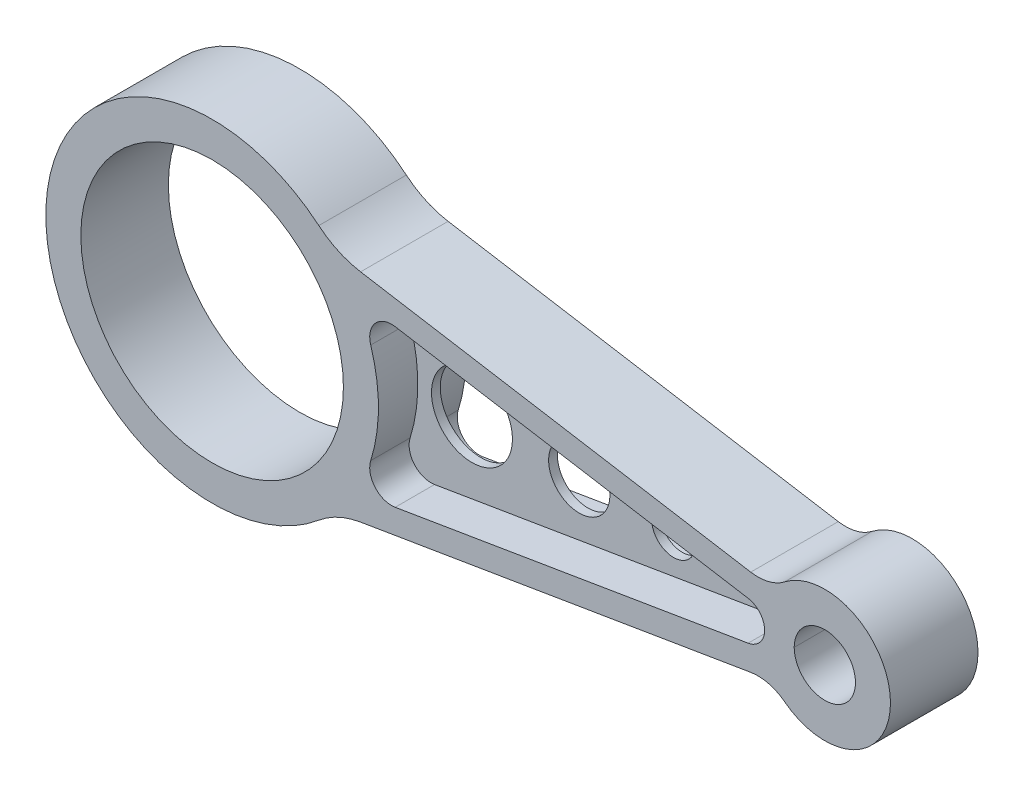
ISO-10303-21;
HEADER;
FILE_DESCRIPTION(('STEP AP214'),'2;1');
FILE_NAME('part.step','',(''),(''),'','','');
FILE_SCHEMA(('AUTOMOTIVE_DESIGN { 1 0 10303 214 1 1 1 1 }'));
ENDSEC;
DATA;
#1=APPLICATION_CONTEXT('core data for automotive mechanical design processes');
#2=APPLICATION_PROTOCOL_DEFINITION('international standard','automotive_design',2000,#1);
#3=PRODUCT_CONTEXT('',#1,'mechanical');
#4=PRODUCT('Part','Part','',(#3));
#5=PRODUCT_RELATED_PRODUCT_CATEGORY('part','',(#4));
#6=PRODUCT_DEFINITION_FORMATION('','',#4);
#7=PRODUCT_DEFINITION_CONTEXT('part definition',#1,'design');
#8=PRODUCT_DEFINITION('design','',#6,#7);
#9=PRODUCT_DEFINITION_SHAPE('','',#8);
#10=(LENGTH_UNIT() NAMED_UNIT(*) SI_UNIT(.MILLI.,.METRE.));
#11=(NAMED_UNIT(*) PLANE_ANGLE_UNIT() SI_UNIT($,.RADIAN.));
#12=(NAMED_UNIT(*) SI_UNIT($,.STERADIAN.) SOLID_ANGLE_UNIT());
#13=UNCERTAINTY_MEASURE_WITH_UNIT(LENGTH_MEASURE(1.E-05),#10,'distance_accuracy_value','');
#14=(GEOMETRIC_REPRESENTATION_CONTEXT(3) GLOBAL_UNCERTAINTY_ASSIGNED_CONTEXT((#13)) GLOBAL_UNIT_ASSIGNED_CONTEXT((#10,
#11,#12)) REPRESENTATION_CONTEXT('',''));
#15=CARTESIAN_POINT('',(0.,0.,0.));
#16=DIRECTION('',(0.,0.,1.));
#17=DIRECTION('',(1.,0.,0.));
#18=AXIS2_PLACEMENT_3D('',#15,#16,#17);
#19=CARTESIAN_POINT('',(140.,0.,10.));
#20=DIRECTION('',(0.,0.,-1.));
#21=DIRECTION('',(-1.,0.,0.));
#22=AXIS2_PLACEMENT_3D('',#19,#20,#21);
#23=CYLINDRICAL_SURFACE('',#22,7.00000000000001);
#24=CARTESIAN_POINT('',(140.,0.,10.));
#25=DIRECTION('',(0.,0.,1.));
#26=DIRECTION('',(1.,0.,0.));
#27=AXIS2_PLACEMENT_3D('',#24,#25,#26);
#28=CIRCLE('',#27,7.00000000000001);
#29=CARTESIAN_POINT('',(133.,0.,10.));
#30=VERTEX_POINT('',#29);
#31=CARTESIAN_POINT('',(147.,0.,10.));
#32=VERTEX_POINT('',#31);
#33=EDGE_CURVE('E337',#30,#32,#28,.T.);
#34=ORIENTED_EDGE('',*,*,#33,.T.);
#35=DIRECTION('',(0.,0.,-1.));
#36=VECTOR('',#35,1.);
#37=CARTESIAN_POINT('',(147.,0.,10.));
#38=LINE('',#37,#36);
#39=CARTESIAN_POINT('',(147.,0.,-10.));
#40=VERTEX_POINT('',#39);
#41=EDGE_CURVE('E11',#32,#40,#38,.T.);
#42=ORIENTED_EDGE('',*,*,#41,.T.);
#43=CARTESIAN_POINT('',(140.,0.,-10.));
#44=DIRECTION('',(0.,0.,1.));
#45=DIRECTION('',(1.,0.,0.));
#46=AXIS2_PLACEMENT_3D('',#43,#44,#45);
#47=CIRCLE('',#46,7.00000000000001);
#48=CARTESIAN_POINT('',(133.,0.,-10.));
#49=VERTEX_POINT('',#48);
#50=EDGE_CURVE('E342',#49,#40,#47,.T.);
#51=ORIENTED_EDGE('',*,*,#50,.F.);
#52=DIRECTION('',(0.,0.,1.));
#53=VECTOR('',#52,1.);
#54=CARTESIAN_POINT('',(133.,0.,10.));
#55=LINE('',#54,#53);
#56=EDGE_CURVE('E53',#49,#30,#55,.T.);
#57=ORIENTED_EDGE('',*,*,#56,.T.);
#58=EDGE_LOOP('',(#34,#42,#51,#57));
#59=FACE_BOUND('',#58,.T.);
#60=ADVANCED_FACE('F43',(#59),#23,.F.);
#61=CARTESIAN_POINT('',(0.,0.,10.));
#62=DIRECTION('',(0.,0.,-1.));
#63=DIRECTION('',(-1.,0.,0.));
#64=AXIS2_PLACEMENT_3D('',#61,#62,#63);
#65=PLANE('',#64);
#66=CARTESIAN_POINT('',(41.007125986905,-12.9389187451698,10.));
#67=DIRECTION('',(0.,0.,1.));
#68=DIRECTION('',(-1.,0.,0.));
#69=AXIS2_PLACEMENT_3D('',#66,#67,#68);
#70=CIRCLE('',#69,5.00000000000004);
#71=CARTESIAN_POINT('',(36.2388555233114,-11.4343933096849,10.));
#72=VERTEX_POINT('',#71);
#73=CARTESIAN_POINT('',(41.8285545583336,-17.8709827250914,10.));
#74=VERTEX_POINT('',#73);
#75=EDGE_CURVE('E299',#72,#74,#70,.T.);
#76=ORIENTED_EDGE('',*,*,#75,.F.);
#77=CARTESIAN_POINT('',(0.,0.,10.));
#78=DIRECTION('',(0.,0.,-1.));
#79=DIRECTION('',(-1.,0.,0.));
#80=AXIS2_PLACEMENT_3D('',#77,#78,#79);
#81=CIRCLE('',#80,38.);
#82=CARTESIAN_POINT('',(36.2388555233113,11.4343933096849,10.));
#83=VERTEX_POINT('',#82);
#84=EDGE_CURVE('E259',#83,#72,#81,.T.);
#85=ORIENTED_EDGE('',*,*,#84,.F.);
#86=CARTESIAN_POINT('',(41.0071259869049,12.9389187451698,10.));
#87=DIRECTION('',(0.,0.,1.));
#88=DIRECTION('',(-1.,0.,0.));
#89=AXIS2_PLACEMENT_3D('',#86,#87,#88);
#90=CIRCLE('',#89,5.);
#91=CARTESIAN_POINT('',(41.8285545583335,17.8709827250914,10.));
#92=VERTEX_POINT('',#91);
#93=EDGE_CURVE('E276',#92,#83,#90,.T.);
#94=ORIENTED_EDGE('',*,*,#93,.F.);
#95=DIRECTION('',(-0.986412795984335,0.164285714285714,0.));
#96=VECTOR('',#95,1.);
#97=CARTESIAN_POINT('',(41.8285545583335,17.8709827250914,10.));
#98=LINE('',#97,#96);
#99=CARTESIAN_POINT('',(122.478416149068,4.43885758192951,10.));
#100=VERTEX_POINT('',#99);
#101=EDGE_CURVE('E311',#100,#92,#98,.T.);
#102=ORIENTED_EDGE('',*,*,#101,.F.);
#103=CARTESIAN_POINT('',(121.739130434783,0.,10.));
#104=DIRECTION('',(0.,0.,1.));
#105=DIRECTION('',(-1.,0.,0.));
#106=AXIS2_PLACEMENT_3D('',#103,#104,#105);
#107=CIRCLE('',#106,4.5);
#108=CARTESIAN_POINT('',(122.478416149068,-4.43885758192951,10.));
#109=VERTEX_POINT('',#108);
#110=EDGE_CURVE('E307',#109,#100,#107,.T.);
#111=ORIENTED_EDGE('',*,*,#110,.F.);
#112=DIRECTION('',(0.986412795984335,0.164285714285714,0.));
#113=VECTOR('',#112,1.);
#114=CARTESIAN_POINT('',(41.8285545583336,-17.8709827250914,10.));
#115=LINE('',#114,#113);
#116=EDGE_CURVE('E303',#74,#109,#115,.T.);
#117=ORIENTED_EDGE('',*,*,#116,.F.);
#118=EDGE_LOOP('',(#76,#85,#94,#102,#111,#117));
#119=FACE_BOUND('',#118,.T.);
#120=DIRECTION('',(-0.986412795984335,0.164285714285714,0.));
#121=VECTOR('',#120,1.);
#122=CARTESIAN_POINT('',(27.9354736759495,25.7606154914888,10.));
#123=LINE('',#122,#121);
#124=CARTESIAN_POINT('',(123.068754783715,9.91629645714703,10.));
#125=VERTEX_POINT('',#124);
#126=CARTESIAN_POINT('',(33.9230677395359,24.763389815186,10.));
#127=VERTEX_POINT('',#126);
#128=EDGE_CURVE('E366',#125,#127,#123,.T.);
#129=ORIENTED_EDGE('',*,*,#128,.T.);
#130=CARTESIAN_POINT('',(37.2087820252502,44.4916457348727,10.));
#131=DIRECTION('',(0.,0.,-1.));
#132=DIRECTION('',(-1.,0.,0.));
#133=AXIS2_PLACEMENT_3D('',#130,#131,#132);
#134=CIRCLE('',#133,20.);
#135=CARTESIAN_POINT('',(24.3781675337846,29.1496989297442,10.));
#136=VERTEX_POINT('',#135);
#137=EDGE_CURVE('E434',#127,#136,#134,.T.);
#138=ORIENTED_EDGE('',*,*,#137,.T.);
#139=CARTESIAN_POINT('',(0.,0.,10.));
#140=DIRECTION('',(0.,0.,1.));
#141=DIRECTION('',(-1.,0.,0.));
#142=AXIS2_PLACEMENT_3D('',#139,#140,#141);
#143=CIRCLE('',#142,38.);
#144=CARTESIAN_POINT('',(24.3781675337846,-29.1496989297442,10.));
#145=VERTEX_POINT('',#144);
#146=EDGE_CURVE('E354',#136,#145,#143,.T.);
#147=ORIENTED_EDGE('',*,*,#146,.T.);
#148=CARTESIAN_POINT('',(37.2087820252501,-44.4916457348728,10.));
#149=DIRECTION('',(0.,0.,-1.));
#150=DIRECTION('',(-1.,0.,0.));
#151=AXIS2_PLACEMENT_3D('',#148,#149,#150);
#152=CIRCLE('',#151,20.);
#153=CARTESIAN_POINT('',(33.9230677395358,-24.7633898151861,10.));
#154=VERTEX_POINT('',#153);
#155=EDGE_CURVE('E428',#145,#154,#152,.T.);
#156=ORIENTED_EDGE('',*,*,#155,.T.);
#157=DIRECTION('',(0.986412795984335,0.164285714285714,0.));
#158=VECTOR('',#157,1.);
#159=CARTESIAN_POINT('',(27.9354736759495,-25.7606154914888,10.));
#160=LINE('',#159,#158);
#161=CARTESIAN_POINT('',(123.068754783715,-9.91629645714704,10.));
#162=VERTEX_POINT('',#161);
#163=EDGE_CURVE('E358',#154,#162,#160,.T.);
#164=ORIENTED_EDGE('',*,*,#163,.T.);
#165=CARTESIAN_POINT('',(124.711611926572,-19.7804244169904,10.));
#166=DIRECTION('',(0.,0.,-1.));
#167=DIRECTION('',(-1.,0.,0.));
#168=AXIS2_PLACEMENT_3D('',#165,#166,#167);
#169=CIRCLE('',#168,10.);
#170=CARTESIAN_POINT('',(130.826967155943,-11.8682546501942,10.));
#171=VERTEX_POINT('',#170);
#172=EDGE_CURVE('E408',#162,#171,#169,.T.);
#173=ORIENTED_EDGE('',*,*,#172,.T.);
#174=CARTESIAN_POINT('',(140.,0.,10.));
#175=DIRECTION('',(0.,0.,1.));
#176=DIRECTION('',(-1.,0.,0.));
#177=AXIS2_PLACEMENT_3D('',#174,#175,#176);
#178=CIRCLE('',#177,15.);
#179=CARTESIAN_POINT('',(130.826967155943,11.8682546501942,10.));
#180=VERTEX_POINT('',#179);
#181=EDGE_CURVE('E362',#171,#180,#178,.T.);
#182=ORIENTED_EDGE('',*,*,#181,.T.);
#183=CARTESIAN_POINT('',(124.711611926572,19.7804244169904,10.));
#184=DIRECTION('',(0.,0.,-1.));
#185=DIRECTION('',(-1.,0.,0.));
#186=AXIS2_PLACEMENT_3D('',#183,#184,#185);
#187=CIRCLE('',#186,10.);
#188=EDGE_CURVE('E401',#180,#125,#187,.T.);
#189=ORIENTED_EDGE('',*,*,#188,.T.);
#190=EDGE_LOOP('',(#129,#138,#147,#156,#164,#173,#182,#189));
#191=FACE_BOUND('',#190,.T.);
#192=CARTESIAN_POINT('',(0.,0.,10.));
#193=DIRECTION('',(0.,0.,1.));
#194=DIRECTION('',(1.,0.,0.));
#195=AXIS2_PLACEMENT_3D('',#192,#193,#194);
#196=CIRCLE('',#195,30.);
#197=CARTESIAN_POINT('',(30.,0.,10.));
#198=VERTEX_POINT('',#197);
#199=EDGE_CURVE('E346',#198,#198,#196,.T.);
#200=ORIENTED_EDGE('',*,*,#199,.F.);
#201=EDGE_LOOP('',(#200));
#202=FACE_BOUND('',#201,.T.);
#203=ORIENTED_EDGE('',*,*,#33,.F.);
#204=EDGE_CURVE('E341',#32,#30,#28,.T.);
#205=ORIENTED_EDGE('',*,*,#204,.F.);
#206=EDGE_LOOP('',(#203,#205));
#207=FACE_BOUND('',#206,.T.);
#208=ADVANCED_FACE('F471',(#119,#191,#202,#207),#65,.F.);
#209=CARTESIAN_POINT('',(0.,0.,-10.));
#210=DIRECTION('',(0.,0.,-1.));
#211=DIRECTION('',(-1.,0.,0.));
#212=AXIS2_PLACEMENT_3D('',#209,#210,#211);
#213=PLANE('',#212);
#214=CARTESIAN_POINT('',(41.0071259869049,12.9389187451698,-10.));
#215=DIRECTION('',(0.,0.,1.));
#216=DIRECTION('',(-1.,0.,0.));
#217=AXIS2_PLACEMENT_3D('',#214,#215,#216);
#218=CIRCLE('',#217,5.);
#219=CARTESIAN_POINT('',(41.8285545583335,17.8709827250914,-10.));
#220=VERTEX_POINT('',#219);
#221=CARTESIAN_POINT('',(36.2388555233113,11.4343933096849,-10.));
#222=VERTEX_POINT('',#221);
#223=EDGE_CURVE('E242',#220,#222,#218,.T.);
#224=ORIENTED_EDGE('',*,*,#223,.T.);
#225=CARTESIAN_POINT('',(0.,0.,-10.));
#226=DIRECTION('',(0.,0.,-1.));
#227=DIRECTION('',(-1.,0.,0.));
#228=AXIS2_PLACEMENT_3D('',#225,#226,#227);
#229=CIRCLE('',#228,38.);
#230=CARTESIAN_POINT('',(36.2388555233114,-11.4343933096849,-10.));
#231=VERTEX_POINT('',#230);
#232=EDGE_CURVE('E213',#222,#231,#229,.T.);
#233=ORIENTED_EDGE('',*,*,#232,.T.);
#234=CARTESIAN_POINT('',(41.007125986905,-12.9389187451698,-10.));
#235=DIRECTION('',(0.,0.,1.));
#236=DIRECTION('',(-1.,0.,0.));
#237=AXIS2_PLACEMENT_3D('',#234,#235,#236);
#238=CIRCLE('',#237,5.00000000000004);
#239=CARTESIAN_POINT('',(41.8285545583336,-17.8709827250914,-10.));
#240=VERTEX_POINT('',#239);
#241=EDGE_CURVE('E220',#231,#240,#238,.T.);
#242=ORIENTED_EDGE('',*,*,#241,.T.);
#243=DIRECTION('',(0.986412795984335,0.164285714285714,0.));
#244=VECTOR('',#243,1.);
#245=CARTESIAN_POINT('',(41.8285545583336,-17.8709827250914,-10.));
#246=LINE('',#245,#244);
#247=CARTESIAN_POINT('',(122.478416149068,-4.43885758192951,-10.));
#248=VERTEX_POINT('',#247);
#249=EDGE_CURVE('E224',#240,#248,#246,.T.);
#250=ORIENTED_EDGE('',*,*,#249,.T.);
#251=CARTESIAN_POINT('',(121.739130434783,0.,-10.));
#252=DIRECTION('',(0.,0.,1.));
#253=DIRECTION('',(-1.,0.,0.));
#254=AXIS2_PLACEMENT_3D('',#251,#252,#253);
#255=CIRCLE('',#254,4.5);
#256=CARTESIAN_POINT('',(122.478416149068,4.43885758192951,-10.));
#257=VERTEX_POINT('',#256);
#258=EDGE_CURVE('E249',#248,#257,#255,.T.);
#259=ORIENTED_EDGE('',*,*,#258,.T.);
#260=DIRECTION('',(-0.986412795984335,0.164285714285714,0.));
#261=VECTOR('',#260,1.);
#262=CARTESIAN_POINT('',(41.8285545583335,17.8709827250914,-10.));
#263=LINE('',#262,#261);
#264=EDGE_CURVE('E245',#257,#220,#263,.T.);
#265=ORIENTED_EDGE('',*,*,#264,.T.);
#266=EDGE_LOOP('',(#224,#233,#242,#250,#259,#265));
#267=FACE_BOUND('',#266,.T.);
#268=CARTESIAN_POINT('',(0.,0.,-10.));
#269=DIRECTION('',(0.,0.,1.));
#270=DIRECTION('',(1.,0.,0.));
#271=AXIS2_PLACEMENT_3D('',#268,#269,#270);
#272=CIRCLE('',#271,30.);
#273=CARTESIAN_POINT('',(30.,0.,-10.));
#274=VERTEX_POINT('',#273);
#275=EDGE_CURVE('E340',#274,#274,#272,.T.);
#276=ORIENTED_EDGE('',*,*,#275,.T.);
#277=EDGE_LOOP('',(#276));
#278=FACE_BOUND('',#277,.T.);
#279=CARTESIAN_POINT('',(0.,0.,-10.));
#280=DIRECTION('',(0.,0.,1.));
#281=DIRECTION('',(-1.,0.,0.));
#282=AXIS2_PLACEMENT_3D('',#279,#280,#281);
#283=CIRCLE('',#282,38.);
#284=CARTESIAN_POINT('',(24.3781675337846,29.1496989297442,-10.));
#285=VERTEX_POINT('',#284);
#286=CARTESIAN_POINT('',(24.3781675337846,-29.1496989297442,-10.));
#287=VERTEX_POINT('',#286);
#288=EDGE_CURVE('E350',#285,#287,#283,.T.);
#289=ORIENTED_EDGE('',*,*,#288,.F.);
#290=CARTESIAN_POINT('',(37.2087820252502,44.4916457348727,-10.));
#291=DIRECTION('',(0.,0.,-1.));
#292=DIRECTION('',(-1.,0.,0.));
#293=AXIS2_PLACEMENT_3D('',#290,#291,#292);
#294=CIRCLE('',#293,20.);
#295=CARTESIAN_POINT('',(33.9230677395359,24.763389815186,-10.));
#296=VERTEX_POINT('',#295);
#297=EDGE_CURVE('E431',#285,#296,#294,.F.);
#298=ORIENTED_EDGE('',*,*,#297,.T.);
#299=DIRECTION('',(-0.986412795984335,0.164285714285714,0.));
#300=VECTOR('',#299,1.);
#301=CARTESIAN_POINT('',(27.9354736759495,25.7606154914888,-10.));
#302=LINE('',#301,#300);
#303=CARTESIAN_POINT('',(123.068754783715,9.91629645714703,-10.));
#304=VERTEX_POINT('',#303);
#305=EDGE_CURVE('E359',#304,#296,#302,.T.);
#306=ORIENTED_EDGE('',*,*,#305,.F.);
#307=CARTESIAN_POINT('',(124.711611926572,19.7804244169904,-10.));
#308=DIRECTION('',(0.,0.,-1.));
#309=DIRECTION('',(-1.,0.,0.));
#310=AXIS2_PLACEMENT_3D('',#307,#308,#309);
#311=CIRCLE('',#310,10.);
#312=CARTESIAN_POINT('',(130.826967155943,11.8682546501942,-10.));
#313=VERTEX_POINT('',#312);
#314=EDGE_CURVE('E398',#304,#313,#311,.F.);
#315=ORIENTED_EDGE('',*,*,#314,.T.);
#316=CARTESIAN_POINT('',(140.,0.,-10.));
#317=DIRECTION('',(0.,0.,1.));
#318=DIRECTION('',(-1.,0.,0.));
#319=AXIS2_PLACEMENT_3D('',#316,#317,#318);
#320=CIRCLE('',#319,15.);
#321=CARTESIAN_POINT('',(130.826967155943,-11.8682546501942,-10.));
#322=VERTEX_POINT('',#321);
#323=EDGE_CURVE('E377',#322,#313,#320,.T.);
#324=ORIENTED_EDGE('',*,*,#323,.F.);
#325=CARTESIAN_POINT('',(124.711611926572,-19.7804244169904,-10.));
#326=DIRECTION('',(0.,0.,-1.));
#327=DIRECTION('',(-1.,0.,0.));
#328=AXIS2_PLACEMENT_3D('',#325,#326,#327);
#329=CIRCLE('',#328,10.);
#330=CARTESIAN_POINT('',(123.068754783715,-9.91629645714704,-10.));
#331=VERTEX_POINT('',#330);
#332=EDGE_CURVE('E404',#322,#331,#329,.F.);
#333=ORIENTED_EDGE('',*,*,#332,.T.);
#334=DIRECTION('',(0.986412795984335,0.164285714285714,0.));
#335=VECTOR('',#334,1.);
#336=CARTESIAN_POINT('',(27.9354736759495,-25.7606154914888,-10.));
#337=LINE('',#336,#335);
#338=CARTESIAN_POINT('',(33.9230677395358,-24.7633898151861,-10.));
#339=VERTEX_POINT('',#338);
#340=EDGE_CURVE('E374',#339,#331,#337,.T.);
#341=ORIENTED_EDGE('',*,*,#340,.F.);
#342=CARTESIAN_POINT('',(37.2087820252501,-44.4916457348728,-10.));
#343=DIRECTION('',(0.,0.,-1.));
#344=DIRECTION('',(-1.,0.,0.));
#345=AXIS2_PLACEMENT_3D('',#342,#343,#344);
#346=CIRCLE('',#345,20.);
#347=EDGE_CURVE('E425',#339,#287,#346,.F.);
#348=ORIENTED_EDGE('',*,*,#347,.T.);
#349=EDGE_LOOP('',(#289,#298,#306,#315,#324,#333,#341,#348));
#350=FACE_BOUND('',#349,.T.);
#351=ORIENTED_EDGE('',*,*,#50,.T.);
#352=EDGE_CURVE('E321',#40,#49,#47,.T.);
#353=ORIENTED_EDGE('',*,*,#352,.T.);
#354=EDGE_LOOP('',(#351,#353));
#355=FACE_BOUND('',#354,.T.);
#356=ADVANCED_FACE('F477',(#267,#278,#350,#355),#213,.T.);
#357=CARTESIAN_POINT('',(0.,0.,10.));
#358=DIRECTION('',(0.,0.,-1.));
#359=DIRECTION('',(-1.,0.,0.));
#360=AXIS2_PLACEMENT_3D('',#357,#358,#359);
#361=CYLINDRICAL_SURFACE('',#360,38.);
#362=ORIENTED_EDGE('',*,*,#288,.T.);
#363=DIRECTION('',(0.,0.,-1.));
#364=VECTOR('',#363,1.);
#365=CARTESIAN_POINT('',(24.3781675337846,-29.1496989297442,10.));
#366=LINE('',#365,#364);
#367=EDGE_CURVE('E419',#287,#145,#366,.F.);
#368=ORIENTED_EDGE('',*,*,#367,.T.);
#369=ORIENTED_EDGE('',*,*,#146,.F.);
#370=DIRECTION('',(0.,0.,-1.));
#371=VECTOR('',#370,1.);
#372=CARTESIAN_POINT('',(24.3781675337846,29.1496989297442,10.));
#373=LINE('',#372,#371);
#374=EDGE_CURVE('E415',#136,#285,#373,.T.);
#375=ORIENTED_EDGE('',*,*,#374,.T.);
#376=EDGE_LOOP('',(#362,#368,#369,#375));
#377=FACE_BOUND('',#376,.T.);
#378=ADVANCED_FACE('F503',(#377),#361,.T.);
#379=CARTESIAN_POINT('',(27.9354736759495,-25.7606154914888,10.));
#380=DIRECTION('',(-0.164285714285714,0.986412795984335,0.));
#381=DIRECTION('',(-0.986412795984335,-0.164285714285714,0.));
#382=AXIS2_PLACEMENT_3D('',#379,#380,#381);
#383=PLANE('',#382);
#384=ORIENTED_EDGE('',*,*,#163,.F.);
#385=DIRECTION('',(0.,0.,1.));
#386=VECTOR('',#385,1.);
#387=CARTESIAN_POINT('',(33.9230677395358,-24.7633898151861,-10.));
#388=LINE('',#387,#386);
#389=EDGE_CURVE('E411',#154,#339,#388,.F.);
#390=ORIENTED_EDGE('',*,*,#389,.T.);
#391=ORIENTED_EDGE('',*,*,#340,.T.);
#392=DIRECTION('',(0.,0.,1.));
#393=VECTOR('',#392,1.);
#394=CARTESIAN_POINT('',(123.068754783715,-9.91629645714704,10.));
#395=LINE('',#394,#393);
#396=EDGE_CURVE('E394',#331,#162,#395,.T.);
#397=ORIENTED_EDGE('',*,*,#396,.T.);
#398=EDGE_LOOP('',(#384,#390,#391,#397));
#399=FACE_BOUND('',#398,.T.);
#400=ADVANCED_FACE('F508',(#399),#383,.F.);
#401=CARTESIAN_POINT('',(140.,0.,10.));
#402=DIRECTION('',(0.,0.,-1.));
#403=DIRECTION('',(-1.,0.,0.));
#404=AXIS2_PLACEMENT_3D('',#401,#402,#403);
#405=CYLINDRICAL_SURFACE('',#404,15.);
#406=ORIENTED_EDGE('',*,*,#323,.T.);
#407=DIRECTION('',(0.,0.,-1.));
#408=VECTOR('',#407,1.);
#409=CARTESIAN_POINT('',(130.826967155943,11.8682546501942,10.));
#410=LINE('',#409,#408);
#411=EDGE_CURVE('E391',#313,#180,#410,.F.);
#412=ORIENTED_EDGE('',*,*,#411,.T.);
#413=ORIENTED_EDGE('',*,*,#181,.F.);
#414=DIRECTION('',(0.,0.,-1.));
#415=VECTOR('',#414,1.);
#416=CARTESIAN_POINT('',(130.826967155943,-11.8682546501942,10.));
#417=LINE('',#416,#415);
#418=EDGE_CURVE('E387',#171,#322,#417,.T.);
#419=ORIENTED_EDGE('',*,*,#418,.T.);
#420=EDGE_LOOP('',(#406,#412,#413,#419));
#421=FACE_BOUND('',#420,.T.);
#422=ADVANCED_FACE('F497',(#421),#405,.T.);
#423=CARTESIAN_POINT('',(27.9354736759495,25.7606154914888,10.));
#424=DIRECTION('',(-0.164285714285714,-0.986412795984335,0.));
#425=DIRECTION('',(0.986412795984335,-0.164285714285714,0.));
#426=AXIS2_PLACEMENT_3D('',#423,#424,#425);
#427=PLANE('',#426);
#428=ORIENTED_EDGE('',*,*,#305,.T.);
#429=DIRECTION('',(0.,0.,1.));
#430=VECTOR('',#429,1.);
#431=CARTESIAN_POINT('',(33.9230677395359,24.763389815186,10.));
#432=LINE('',#431,#430);
#433=EDGE_CURVE('E422',#296,#127,#432,.T.);
#434=ORIENTED_EDGE('',*,*,#433,.T.);
#435=ORIENTED_EDGE('',*,*,#128,.F.);
#436=DIRECTION('',(0.,0.,1.));
#437=VECTOR('',#436,1.);
#438=CARTESIAN_POINT('',(123.068754783715,9.91629645714703,-10.));
#439=LINE('',#438,#437);
#440=EDGE_CURVE('E370',#125,#304,#439,.F.);
#441=ORIENTED_EDGE('',*,*,#440,.T.);
#442=EDGE_LOOP('',(#428,#434,#435,#441));
#443=FACE_BOUND('',#442,.T.);
#444=ADVANCED_FACE('F492',(#443),#427,.F.);
#445=CARTESIAN_POINT('',(0.,0.,10.));
#446=DIRECTION('',(0.,0.,-1.));
#447=DIRECTION('',(-1.,0.,0.));
#448=AXIS2_PLACEMENT_3D('',#445,#446,#447);
#449=CYLINDRICAL_SURFACE('',#448,30.);
#450=ORIENTED_EDGE('',*,*,#199,.T.);
#451=EDGE_LOOP('',(#450));
#452=FACE_BOUND('',#451,.T.);
#453=ORIENTED_EDGE('',*,*,#275,.F.);
#454=EDGE_LOOP('',(#453));
#455=FACE_BOUND('',#454,.T.);
#456=ADVANCED_FACE('F484',(#452,#455),#449,.F.);
#457=ORIENTED_EDGE('',*,*,#41,.F.);
#458=ORIENTED_EDGE('',*,*,#204,.T.);
#459=ORIENTED_EDGE('',*,*,#56,.F.);
#460=ORIENTED_EDGE('',*,*,#352,.F.);
#461=EDGE_LOOP('',(#457,#458,#459,#460));
#462=FACE_BOUND('',#461,.T.);
#463=ADVANCED_FACE('F473',(#462),#23,.F.);
#464=CARTESIAN_POINT('',(124.711611926572,19.7804244169904,10.));
#465=DIRECTION('',(0.,0.,-1.));
#466=DIRECTION('',(-1.,0.,0.));
#467=AXIS2_PLACEMENT_3D('',#464,#465,#466);
#468=CYLINDRICAL_SURFACE('',#467,10.);
#469=ORIENTED_EDGE('',*,*,#188,.F.);
#470=ORIENTED_EDGE('',*,*,#411,.F.);
#471=ORIENTED_EDGE('',*,*,#314,.F.);
#472=ORIENTED_EDGE('',*,*,#440,.F.);
#473=EDGE_LOOP('',(#469,#470,#471,#472));
#474=FACE_BOUND('',#473,.T.);
#475=ADVANCED_FACE('F483',(#474),#468,.F.);
#476=CARTESIAN_POINT('',(124.711611926572,-19.7804244169904,10.));
#477=DIRECTION('',(0.,0.,-1.));
#478=DIRECTION('',(-1.,0.,0.));
#479=AXIS2_PLACEMENT_3D('',#476,#477,#478);
#480=CYLINDRICAL_SURFACE('',#479,10.);
#481=ORIENTED_EDGE('',*,*,#172,.F.);
#482=ORIENTED_EDGE('',*,*,#396,.F.);
#483=ORIENTED_EDGE('',*,*,#332,.F.);
#484=ORIENTED_EDGE('',*,*,#418,.F.);
#485=EDGE_LOOP('',(#481,#482,#483,#484));
#486=FACE_BOUND('',#485,.T.);
#487=ADVANCED_FACE('F489',(#486),#480,.F.);
#488=CARTESIAN_POINT('',(37.2087820252501,-44.4916457348728,10.));
#489=DIRECTION('',(0.,0.,-1.));
#490=DIRECTION('',(-1.,0.,0.));
#491=AXIS2_PLACEMENT_3D('',#488,#489,#490);
#492=CYLINDRICAL_SURFACE('',#491,20.);
#493=ORIENTED_EDGE('',*,*,#155,.F.);
#494=ORIENTED_EDGE('',*,*,#367,.F.);
#495=ORIENTED_EDGE('',*,*,#347,.F.);
#496=ORIENTED_EDGE('',*,*,#389,.F.);
#497=EDGE_LOOP('',(#493,#494,#495,#496));
#498=FACE_BOUND('',#497,.T.);
#499=ADVANCED_FACE('F517',(#498),#492,.F.);
#500=CARTESIAN_POINT('',(37.2087820252502,44.4916457348727,10.));
#501=DIRECTION('',(0.,0.,-1.));
#502=DIRECTION('',(-1.,0.,0.));
#503=AXIS2_PLACEMENT_3D('',#500,#501,#502);
#504=CYLINDRICAL_SURFACE('',#503,20.);
#505=ORIENTED_EDGE('',*,*,#137,.F.);
#506=ORIENTED_EDGE('',*,*,#433,.F.);
#507=ORIENTED_EDGE('',*,*,#297,.F.);
#508=ORIENTED_EDGE('',*,*,#374,.F.);
#509=EDGE_LOOP('',(#505,#506,#507,#508));
#510=FACE_BOUND('',#509,.T.);
#511=ADVANCED_FACE('F45',(#510),#504,.F.);
#512=CARTESIAN_POINT('',(0.,0.,1.));
#513=DIRECTION('',(0.,0.,1.));
#514=DIRECTION('',(1.,0.,0.));
#515=AXIS2_PLACEMENT_3D('',#512,#513,#514);
#516=CYLINDRICAL_SURFACE('',#515,38.);
#517=ORIENTED_EDGE('',*,*,#84,.T.);
#518=DIRECTION('',(0.,0.,1.));
#519=VECTOR('',#518,1.);
#520=CARTESIAN_POINT('',(36.2388555233114,-11.4343933096849,1.));
#521=LINE('',#520,#519);
#522=CARTESIAN_POINT('',(36.2388555233114,-11.4343933096849,1.));
#523=VERTEX_POINT('',#522);
#524=EDGE_CURVE('E296',#523,#72,#521,.T.);
#525=ORIENTED_EDGE('',*,*,#524,.F.);
#526=CARTESIAN_POINT('',(0.,0.,1.));
#527=DIRECTION('',(0.,0.,-1.));
#528=DIRECTION('',(-1.,0.,0.));
#529=AXIS2_PLACEMENT_3D('',#526,#527,#528);
#530=CIRCLE('',#529,38.);
#531=CARTESIAN_POINT('',(36.2388555233113,11.4343933096849,1.));
#532=VERTEX_POINT('',#531);
#533=EDGE_CURVE('E271',#532,#523,#530,.T.);
#534=ORIENTED_EDGE('',*,*,#533,.F.);
#535=DIRECTION('',(0.,0.,1.));
#536=VECTOR('',#535,1.);
#537=CARTESIAN_POINT('',(36.2388555233113,11.4343933096849,1.));
#538=LINE('',#537,#536);
#539=EDGE_CURVE('E318',#532,#83,#538,.T.);
#540=ORIENTED_EDGE('',*,*,#539,.T.);
#541=EDGE_LOOP('',(#517,#525,#534,#540));
#542=FACE_BOUND('',#541,.T.);
#543=ADVANCED_FACE('F524',(#542),#516,.T.);
#544=CARTESIAN_POINT('',(41.0071259869049,12.9389187451698,1.));
#545=DIRECTION('',(0.,0.,1.));
#546=DIRECTION('',(1.,0.,0.));
#547=AXIS2_PLACEMENT_3D('',#544,#545,#546);
#548=CYLINDRICAL_SURFACE('',#547,5.);
#549=ORIENTED_EDGE('',*,*,#93,.T.);
#550=ORIENTED_EDGE('',*,*,#539,.F.);
#551=CARTESIAN_POINT('',(41.0071259869049,12.9389187451698,1.));
#552=DIRECTION('',(0.,0.,1.));
#553=DIRECTION('',(-1.,0.,0.));
#554=AXIS2_PLACEMENT_3D('',#551,#552,#553);
#555=CIRCLE('',#554,5.);
#556=CARTESIAN_POINT('',(41.8285545583335,17.8709827250914,1.));
#557=VERTEX_POINT('',#556);
#558=EDGE_CURVE('E292',#557,#532,#555,.T.);
#559=ORIENTED_EDGE('',*,*,#558,.F.);
#560=DIRECTION('',(0.,0.,1.));
#561=VECTOR('',#560,1.);
#562=CARTESIAN_POINT('',(41.8285545583335,17.8709827250914,1.));
#563=LINE('',#562,#561);
#564=EDGE_CURVE('E322',#557,#92,#563,.T.);
#565=ORIENTED_EDGE('',*,*,#564,.T.);
#566=EDGE_LOOP('',(#549,#550,#559,#565));
#567=FACE_BOUND('',#566,.T.);
#568=ADVANCED_FACE('F565',(#567),#548,.F.);
#569=CARTESIAN_POINT('',(41.8285545583335,17.8709827250914,1.));
#570=DIRECTION('',(0.164285714285714,0.986412795984335,0.));
#571=DIRECTION('',(-0.986412795984335,0.164285714285714,0.));
#572=AXIS2_PLACEMENT_3D('',#569,#570,#571);
#573=PLANE('',#572);
#574=ORIENTED_EDGE('',*,*,#101,.T.);
#575=ORIENTED_EDGE('',*,*,#564,.F.);
#576=DIRECTION('',(-0.986412795984335,0.164285714285714,0.));
#577=VECTOR('',#576,1.);
#578=CARTESIAN_POINT('',(41.8285545583335,17.8709827250914,1.));
#579=LINE('',#578,#577);
#580=CARTESIAN_POINT('',(122.478416149068,4.43885758192951,1.));
#581=VERTEX_POINT('',#580);
#582=EDGE_CURVE('E288',#581,#557,#579,.T.);
#583=ORIENTED_EDGE('',*,*,#582,.F.);
#584=DIRECTION('',(0.,0.,1.));
#585=VECTOR('',#584,1.);
#586=CARTESIAN_POINT('',(122.478416149068,4.43885758192951,1.));
#587=LINE('',#586,#585);
#588=EDGE_CURVE('E325',#581,#100,#587,.T.);
#589=ORIENTED_EDGE('',*,*,#588,.T.);
#590=EDGE_LOOP('',(#574,#575,#583,#589));
#591=FACE_BOUND('',#590,.T.);
#592=ADVANCED_FACE('F570',(#591),#573,.F.);
#593=CARTESIAN_POINT('',(121.739130434783,0.,1.));
#594=DIRECTION('',(0.,0.,1.));
#595=DIRECTION('',(1.,0.,0.));
#596=AXIS2_PLACEMENT_3D('',#593,#594,#595);
#597=CYLINDRICAL_SURFACE('',#596,4.5);
#598=ORIENTED_EDGE('',*,*,#110,.T.);
#599=ORIENTED_EDGE('',*,*,#588,.F.);
#600=CARTESIAN_POINT('',(121.739130434783,0.,1.));
#601=DIRECTION('',(0.,0.,1.));
#602=DIRECTION('',(-1.,0.,0.));
#603=AXIS2_PLACEMENT_3D('',#600,#601,#602);
#604=CIRCLE('',#603,4.5);
#605=CARTESIAN_POINT('',(122.478416149068,-4.43885758192951,1.));
#606=VERTEX_POINT('',#605);
#607=EDGE_CURVE('E284',#606,#581,#604,.T.);
#608=ORIENTED_EDGE('',*,*,#607,.F.);
#609=DIRECTION('',(0.,0.,1.));
#610=VECTOR('',#609,1.);
#611=CARTESIAN_POINT('',(122.478416149068,-4.43885758192951,1.));
#612=LINE('',#611,#610);
#613=EDGE_CURVE('E328',#606,#109,#612,.T.);
#614=ORIENTED_EDGE('',*,*,#613,.T.);
#615=EDGE_LOOP('',(#598,#599,#608,#614));
#616=FACE_BOUND('',#615,.T.);
#617=ADVANCED_FACE('F582',(#616),#597,.F.);
#618=CARTESIAN_POINT('',(41.8285545583336,-17.8709827250914,1.));
#619=DIRECTION('',(0.164285714285714,-0.986412795984335,0.));
#620=DIRECTION('',(0.986412795984335,0.164285714285714,0.));
#621=AXIS2_PLACEMENT_3D('',#618,#619,#620);
#622=PLANE('',#621);
#623=ORIENTED_EDGE('',*,*,#116,.T.);
#624=ORIENTED_EDGE('',*,*,#613,.F.);
#625=DIRECTION('',(0.986412795984335,0.164285714285714,0.));
#626=VECTOR('',#625,1.);
#627=CARTESIAN_POINT('',(41.8285545583336,-17.8709827250914,1.));
#628=LINE('',#627,#626);
#629=CARTESIAN_POINT('',(41.8285545583336,-17.8709827250914,1.));
#630=VERTEX_POINT('',#629);
#631=EDGE_CURVE('E280',#630,#606,#628,.T.);
#632=ORIENTED_EDGE('',*,*,#631,.F.);
#633=DIRECTION('',(0.,0.,1.));
#634=VECTOR('',#633,1.);
#635=CARTESIAN_POINT('',(41.8285545583336,-17.8709827250914,1.));
#636=LINE('',#635,#634);
#637=EDGE_CURVE('E331',#630,#74,#636,.T.);
#638=ORIENTED_EDGE('',*,*,#637,.T.);
#639=EDGE_LOOP('',(#623,#624,#632,#638));
#640=FACE_BOUND('',#639,.T.);
#641=ADVANCED_FACE('F578',(#640),#622,.F.);
#642=CARTESIAN_POINT('',(41.007125986905,-12.9389187451698,1.));
#643=DIRECTION('',(0.,0.,1.));
#644=DIRECTION('',(1.,0.,0.));
#645=AXIS2_PLACEMENT_3D('',#642,#643,#644);
#646=CYLINDRICAL_SURFACE('',#645,5.00000000000004);
#647=ORIENTED_EDGE('',*,*,#75,.T.);
#648=ORIENTED_EDGE('',*,*,#637,.F.);
#649=CARTESIAN_POINT('',(41.007125986905,-12.9389187451698,1.));
#650=DIRECTION('',(0.,0.,1.));
#651=DIRECTION('',(-1.,0.,0.));
#652=AXIS2_PLACEMENT_3D('',#649,#650,#651);
#653=CIRCLE('',#652,5.00000000000004);
#654=EDGE_CURVE('E275',#523,#630,#653,.T.);
#655=ORIENTED_EDGE('',*,*,#654,.F.);
#656=ORIENTED_EDGE('',*,*,#524,.T.);
#657=EDGE_LOOP('',(#647,#648,#655,#656));
#658=FACE_BOUND('',#657,.T.);
#659=ADVANCED_FACE('F574',(#658),#646,.F.);
#660=CARTESIAN_POINT('',(0.,0.,1.));
#661=DIRECTION('',(0.,0.,-1.));
#662=DIRECTION('',(-1.,0.,0.));
#663=AXIS2_PLACEMENT_3D('',#660,#661,#662);
#664=PLANE('',#663);
#665=CARTESIAN_POINT('',(50.3713688216154,0.,1.));
#666=DIRECTION('',(0.,0.,1.));
#667=DIRECTION('',(1.,0.,0.));
#668=AXIS2_PLACEMENT_3D('',#665,#666,#667);
#669=CIRCLE('',#668,9.25);
#670=CARTESIAN_POINT('',(59.6213688216154,0.,1.));
#671=VERTEX_POINT('',#670);
#672=EDGE_CURVE('E445',#671,#671,#669,.T.);
#673=ORIENTED_EDGE('',*,*,#672,.F.);
#674=EDGE_LOOP('',(#673));
#675=FACE_BOUND('',#674,.T.);
#676=CARTESIAN_POINT('',(74.8899101595823,0.,1.));
#677=DIRECTION('',(0.,0.,1.));
#678=DIRECTION('',(1.,0.,0.));
#679=AXIS2_PLACEMENT_3D('',#676,#677,#678);
#680=CIRCLE('',#679,7.);
#681=CARTESIAN_POINT('',(81.8899101595823,0.,1.));
#682=VERTEX_POINT('',#681);
#683=EDGE_CURVE('E634',#682,#682,#680,.T.);
#684=ORIENTED_EDGE('',*,*,#683,.F.);
#685=EDGE_LOOP('',(#684));
#686=FACE_BOUND('',#685,.T.);
#687=CARTESIAN_POINT('',(96.4405081274505,0.,1.));
#688=DIRECTION('',(0.,0.,1.));
#689=DIRECTION('',(1.,0.,0.));
#690=AXIS2_PLACEMENT_3D('',#687,#688,#689);
#691=CIRCLE('',#690,5.);
#692=CARTESIAN_POINT('',(101.440508127451,0.,1.));
#693=VERTEX_POINT('',#692);
#694=EDGE_CURVE('E626',#693,#693,#691,.T.);
#695=ORIENTED_EDGE('',*,*,#694,.F.);
#696=EDGE_LOOP('',(#695));
#697=FACE_BOUND('',#696,.T.);
#698=CARTESIAN_POINT('',(112.976627130934,0.,1.));
#699=DIRECTION('',(0.,0.,1.));
#700=DIRECTION('',(1.,0.,0.));
#701=AXIS2_PLACEMENT_3D('',#698,#699,#700);
#702=CIRCLE('',#701,3.02375892794177);
#703=CARTESIAN_POINT('',(116.000386058876,0.,1.));
#704=VERTEX_POINT('',#703);
#705=EDGE_CURVE('E227',#704,#704,#702,.T.);
#706=ORIENTED_EDGE('',*,*,#705,.F.);
#707=EDGE_LOOP('',(#706));
#708=FACE_BOUND('',#707,.T.);
#709=ORIENTED_EDGE('',*,*,#533,.T.);
#710=ORIENTED_EDGE('',*,*,#654,.T.);
#711=ORIENTED_EDGE('',*,*,#631,.T.);
#712=ORIENTED_EDGE('',*,*,#607,.T.);
#713=ORIENTED_EDGE('',*,*,#582,.T.);
#714=ORIENTED_EDGE('',*,*,#558,.T.);
#715=EDGE_LOOP('',(#709,#710,#711,#712,#713,#714));
#716=FACE_BOUND('',#715,.T.);
#717=ADVANCED_FACE('F577',(#675,#686,#697,#708,#716),#664,.F.);
#718=CARTESIAN_POINT('',(0.,0.,-1.));
#719=DIRECTION('',(0.,0.,-1.));
#720=DIRECTION('',(-1.,0.,0.));
#721=AXIS2_PLACEMENT_3D('',#718,#719,#720);
#722=CYLINDRICAL_SURFACE('',#721,38.);
#723=ORIENTED_EDGE('',*,*,#232,.F.);
#724=DIRECTION('',(0.,0.,-1.));
#725=VECTOR('',#724,1.);
#726=CARTESIAN_POINT('',(36.2388555233113,11.4343933096849,-1.));
#727=LINE('',#726,#725);
#728=CARTESIAN_POINT('',(36.2388555233113,11.4343933096849,-1.));
#729=VERTEX_POINT('',#728);
#730=EDGE_CURVE('E197',#729,#222,#727,.T.);
#731=ORIENTED_EDGE('',*,*,#730,.F.);
#732=CARTESIAN_POINT('',(0.,0.,-1.));
#733=DIRECTION('',(0.,0.,-1.));
#734=DIRECTION('',(-1.,0.,0.));
#735=AXIS2_PLACEMENT_3D('',#732,#733,#734);
#736=CIRCLE('',#735,38.);
#737=CARTESIAN_POINT('',(36.2388555233114,-11.4343933096849,-1.));
#738=VERTEX_POINT('',#737);
#739=EDGE_CURVE('E205',#729,#738,#736,.T.);
#740=ORIENTED_EDGE('',*,*,#739,.T.);
#741=DIRECTION('',(0.,0.,-1.));
#742=VECTOR('',#741,1.);
#743=CARTESIAN_POINT('',(36.2388555233114,-11.4343933096849,-1.));
#744=LINE('',#743,#742);
#745=EDGE_CURVE('E256',#738,#231,#744,.T.);
#746=ORIENTED_EDGE('',*,*,#745,.T.);
#747=EDGE_LOOP('',(#723,#731,#740,#746));
#748=FACE_BOUND('',#747,.T.);
#749=ADVANCED_FACE('F209',(#748),#722,.T.);
#750=CARTESIAN_POINT('',(41.007125986905,-12.9389187451698,-1.));
#751=DIRECTION('',(0.,0.,-1.));
#752=DIRECTION('',(-1.,0.,0.));
#753=AXIS2_PLACEMENT_3D('',#750,#751,#752);
#754=CYLINDRICAL_SURFACE('',#753,5.00000000000004);
#755=ORIENTED_EDGE('',*,*,#241,.F.);
#756=ORIENTED_EDGE('',*,*,#745,.F.);
#757=CARTESIAN_POINT('',(41.007125986905,-12.9389187451698,-1.));
#758=DIRECTION('',(0.,0.,1.));
#759=DIRECTION('',(-1.,0.,0.));
#760=AXIS2_PLACEMENT_3D('',#757,#758,#759);
#761=CIRCLE('',#760,5.00000000000004);
#762=CARTESIAN_POINT('',(41.8285545583336,-17.8709827250914,-1.));
#763=VERTEX_POINT('',#762);
#764=EDGE_CURVE('E215',#738,#763,#761,.T.);
#765=ORIENTED_EDGE('',*,*,#764,.T.);
#766=DIRECTION('',(0.,0.,-1.));
#767=VECTOR('',#766,1.);
#768=CARTESIAN_POINT('',(41.8285545583336,-17.8709827250914,-1.));
#769=LINE('',#768,#767);
#770=EDGE_CURVE('E260',#763,#240,#769,.T.);
#771=ORIENTED_EDGE('',*,*,#770,.T.);
#772=EDGE_LOOP('',(#755,#756,#765,#771));
#773=FACE_BOUND('',#772,.T.);
#774=ADVANCED_FACE('F595',(#773),#754,.F.);
#775=CARTESIAN_POINT('',(41.8285545583336,-17.8709827250914,-1.));
#776=DIRECTION('',(-0.164285714285714,0.986412795984335,0.));
#777=DIRECTION('',(-0.986412795984335,-0.164285714285714,0.));
#778=AXIS2_PLACEMENT_3D('',#775,#776,#777);
#779=PLANE('',#778);
#780=ORIENTED_EDGE('',*,*,#249,.F.);
#781=ORIENTED_EDGE('',*,*,#770,.F.);
#782=DIRECTION('',(0.986412795984335,0.164285714285714,0.));
#783=VECTOR('',#782,1.);
#784=CARTESIAN_POINT('',(41.8285545583336,-17.8709827250914,-1.));
#785=LINE('',#784,#783);
#786=CARTESIAN_POINT('',(122.478416149068,-4.43885758192951,-1.));
#787=VERTEX_POINT('',#786);
#788=EDGE_CURVE('E235',#763,#787,#785,.T.);
#789=ORIENTED_EDGE('',*,*,#788,.T.);
#790=DIRECTION('',(0.,0.,-1.));
#791=VECTOR('',#790,1.);
#792=CARTESIAN_POINT('',(122.478416149068,-4.43885758192951,-1.));
#793=LINE('',#792,#791);
#794=EDGE_CURVE('E263',#787,#248,#793,.T.);
#795=ORIENTED_EDGE('',*,*,#794,.T.);
#796=EDGE_LOOP('',(#780,#781,#789,#795));
#797=FACE_BOUND('',#796,.T.);
#798=ADVANCED_FACE('F605',(#797),#779,.T.);
#799=CARTESIAN_POINT('',(121.739130434783,0.,-1.));
#800=DIRECTION('',(0.,0.,-1.));
#801=DIRECTION('',(-1.,0.,0.));
#802=AXIS2_PLACEMENT_3D('',#799,#800,#801);
#803=CYLINDRICAL_SURFACE('',#802,4.5);
#804=ORIENTED_EDGE('',*,*,#258,.F.);
#805=ORIENTED_EDGE('',*,*,#794,.F.);
#806=CARTESIAN_POINT('',(121.739130434783,0.,-1.));
#807=DIRECTION('',(0.,0.,1.));
#808=DIRECTION('',(-1.,0.,0.));
#809=AXIS2_PLACEMENT_3D('',#806,#807,#808);
#810=CIRCLE('',#809,4.5);
#811=CARTESIAN_POINT('',(122.478416149068,4.43885758192951,-1.));
#812=VERTEX_POINT('',#811);
#813=EDGE_CURVE('E232',#787,#812,#810,.T.);
#814=ORIENTED_EDGE('',*,*,#813,.T.);
#815=DIRECTION('',(0.,0.,-1.));
#816=VECTOR('',#815,1.);
#817=CARTESIAN_POINT('',(122.478416149068,4.43885758192951,-1.));
#818=LINE('',#817,#816);
#819=EDGE_CURVE('E266',#812,#257,#818,.T.);
#820=ORIENTED_EDGE('',*,*,#819,.T.);
#821=EDGE_LOOP('',(#804,#805,#814,#820));
#822=FACE_BOUND('',#821,.T.);
#823=ADVANCED_FACE('F601',(#822),#803,.F.);
#824=CARTESIAN_POINT('',(41.8285545583335,17.8709827250914,-1.));
#825=DIRECTION('',(-0.164285714285714,-0.986412795984335,0.));
#826=DIRECTION('',(0.986412795984335,-0.164285714285714,0.));
#827=AXIS2_PLACEMENT_3D('',#824,#825,#826);
#828=PLANE('',#827);
#829=ORIENTED_EDGE('',*,*,#264,.F.);
#830=ORIENTED_EDGE('',*,*,#819,.F.);
#831=DIRECTION('',(-0.986412795984335,0.164285714285714,0.));
#832=VECTOR('',#831,1.);
#833=CARTESIAN_POINT('',(41.8285545583335,17.8709827250914,-1.));
#834=LINE('',#833,#832);
#835=CARTESIAN_POINT('',(41.8285545583335,17.8709827250914,-1.));
#836=VERTEX_POINT('',#835);
#837=EDGE_CURVE('E204',#812,#836,#834,.T.);
#838=ORIENTED_EDGE('',*,*,#837,.T.);
#839=DIRECTION('',(0.,0.,-1.));
#840=VECTOR('',#839,1.);
#841=CARTESIAN_POINT('',(41.8285545583335,17.8709827250914,-1.));
#842=LINE('',#841,#840);
#843=EDGE_CURVE('E199',#836,#220,#842,.T.);
#844=ORIENTED_EDGE('',*,*,#843,.T.);
#845=EDGE_LOOP('',(#829,#830,#838,#844));
#846=FACE_BOUND('',#845,.T.);
#847=ADVANCED_FACE('F598',(#846),#828,.T.);
#848=CARTESIAN_POINT('',(41.0071259869049,12.9389187451698,-1.));
#849=DIRECTION('',(0.,0.,-1.));
#850=DIRECTION('',(-1.,0.,0.));
#851=AXIS2_PLACEMENT_3D('',#848,#849,#850);
#852=CYLINDRICAL_SURFACE('',#851,5.);
#853=ORIENTED_EDGE('',*,*,#223,.F.);
#854=ORIENTED_EDGE('',*,*,#843,.F.);
#855=CARTESIAN_POINT('',(41.0071259869049,12.9389187451698,-1.));
#856=DIRECTION('',(0.,0.,1.));
#857=DIRECTION('',(-1.,0.,0.));
#858=AXIS2_PLACEMENT_3D('',#855,#856,#857);
#859=CIRCLE('',#858,5.);
#860=EDGE_CURVE('E193',#836,#729,#859,.T.);
#861=ORIENTED_EDGE('',*,*,#860,.T.);
#862=ORIENTED_EDGE('',*,*,#730,.T.);
#863=EDGE_LOOP('',(#853,#854,#861,#862));
#864=FACE_BOUND('',#863,.T.);
#865=ADVANCED_FACE('F196',(#864),#852,.F.);
#866=CARTESIAN_POINT('',(0.,0.,-1.));
#867=DIRECTION('',(0.,0.,1.));
#868=DIRECTION('',(-1.,0.,0.));
#869=AXIS2_PLACEMENT_3D('',#866,#867,#868);
#870=PLANE('',#869);
#871=CARTESIAN_POINT('',(50.3713688216154,0.,-1.));
#872=DIRECTION('',(0.,0.,1.));
#873=DIRECTION('',(1.,0.,0.));
#874=AXIS2_PLACEMENT_3D('',#871,#872,#873);
#875=CIRCLE('',#874,9.25);
#876=CARTESIAN_POINT('',(59.6213688216154,0.,-1.));
#877=VERTEX_POINT('',#876);
#878=EDGE_CURVE('E47',#877,#877,#875,.T.);
#879=ORIENTED_EDGE('',*,*,#878,.T.);
#880=EDGE_LOOP('',(#879));
#881=FACE_BOUND('',#880,.T.);
#882=CARTESIAN_POINT('',(74.8899101595823,0.,-1.));
#883=DIRECTION('',(0.,0.,1.));
#884=DIRECTION('',(1.,0.,0.));
#885=AXIS2_PLACEMENT_3D('',#882,#883,#884);
#886=CIRCLE('',#885,7.);
#887=CARTESIAN_POINT('',(81.8899101595823,0.,-1.));
#888=VERTEX_POINT('',#887);
#889=EDGE_CURVE('E448',#888,#888,#886,.T.);
#890=ORIENTED_EDGE('',*,*,#889,.T.);
#891=EDGE_LOOP('',(#890));
#892=FACE_BOUND('',#891,.T.);
#893=CARTESIAN_POINT('',(96.4405081274505,0.,-1.));
#894=DIRECTION('',(0.,0.,1.));
#895=DIRECTION('',(1.,0.,0.));
#896=AXIS2_PLACEMENT_3D('',#893,#894,#895);
#897=CIRCLE('',#896,5.);
#898=CARTESIAN_POINT('',(101.440508127451,0.,-1.));
#899=VERTEX_POINT('',#898);
#900=EDGE_CURVE('E444',#899,#899,#897,.T.);
#901=ORIENTED_EDGE('',*,*,#900,.T.);
#902=EDGE_LOOP('',(#901));
#903=FACE_BOUND('',#902,.T.);
#904=CARTESIAN_POINT('',(112.976627130934,0.,-1.));
#905=DIRECTION('',(0.,0.,1.));
#906=DIRECTION('',(1.,0.,0.));
#907=AXIS2_PLACEMENT_3D('',#904,#905,#906);
#908=CIRCLE('',#907,3.02375892794177);
#909=CARTESIAN_POINT('',(116.000386058876,0.,-1.));
#910=VERTEX_POINT('',#909);
#911=EDGE_CURVE('E440',#910,#910,#908,.T.);
#912=ORIENTED_EDGE('',*,*,#911,.T.);
#913=EDGE_LOOP('',(#912));
#914=FACE_BOUND('',#913,.T.);
#915=ORIENTED_EDGE('',*,*,#739,.F.);
#916=ORIENTED_EDGE('',*,*,#860,.F.);
#917=ORIENTED_EDGE('',*,*,#837,.F.);
#918=ORIENTED_EDGE('',*,*,#813,.F.);
#919=ORIENTED_EDGE('',*,*,#788,.F.);
#920=ORIENTED_EDGE('',*,*,#764,.F.);
#921=EDGE_LOOP('',(#915,#916,#917,#918,#919,#920));
#922=FACE_BOUND('',#921,.T.);
#923=ADVANCED_FACE('F217',(#881,#892,#903,#914,#922),#870,.F.);
#924=CARTESIAN_POINT('',(112.976627130934,0.,-10.));
#925=DIRECTION('',(0.,0.,1.));
#926=DIRECTION('',(1.,0.,0.));
#927=AXIS2_PLACEMENT_3D('',#924,#925,#926);
#928=CYLINDRICAL_SURFACE('',#927,3.02375892794177);
#929=ORIENTED_EDGE('',*,*,#705,.T.);
#930=EDGE_LOOP('',(#929));
#931=FACE_BOUND('',#930,.T.);
#932=ORIENTED_EDGE('',*,*,#911,.F.);
#933=EDGE_LOOP('',(#932));
#934=FACE_BOUND('',#933,.T.);
#935=ADVANCED_FACE('F615',(#931,#934),#928,.F.);
#936=CARTESIAN_POINT('',(96.4405081274505,0.,-10.));
#937=DIRECTION('',(0.,0.,1.));
#938=DIRECTION('',(1.,0.,0.));
#939=AXIS2_PLACEMENT_3D('',#936,#937,#938);
#940=CYLINDRICAL_SURFACE('',#939,5.);
#941=ORIENTED_EDGE('',*,*,#694,.T.);
#942=EDGE_LOOP('',(#941));
#943=FACE_BOUND('',#942,.T.);
#944=ORIENTED_EDGE('',*,*,#900,.F.);
#945=EDGE_LOOP('',(#944));
#946=FACE_BOUND('',#945,.T.);
#947=ADVANCED_FACE('F466',(#943,#946),#940,.F.);
#948=CARTESIAN_POINT('',(74.8899101595823,0.,-10.));
#949=DIRECTION('',(0.,0.,1.));
#950=DIRECTION('',(1.,0.,0.));
#951=AXIS2_PLACEMENT_3D('',#948,#949,#950);
#952=CYLINDRICAL_SURFACE('',#951,7.);
#953=ORIENTED_EDGE('',*,*,#683,.T.);
#954=EDGE_LOOP('',(#953));
#955=FACE_BOUND('',#954,.T.);
#956=ORIENTED_EDGE('',*,*,#889,.F.);
#957=EDGE_LOOP('',(#956));
#958=FACE_BOUND('',#957,.T.);
#959=ADVANCED_FACE('F460',(#955,#958),#952,.F.);
#960=CARTESIAN_POINT('',(50.3713688216154,0.,-10.));
#961=DIRECTION('',(0.,0.,1.));
#962=DIRECTION('',(1.,0.,0.));
#963=AXIS2_PLACEMENT_3D('',#960,#961,#962);
#964=CYLINDRICAL_SURFACE('',#963,9.25);
#965=ORIENTED_EDGE('',*,*,#672,.T.);
#966=EDGE_LOOP('',(#965));
#967=FACE_BOUND('',#966,.T.);
#968=ORIENTED_EDGE('',*,*,#878,.F.);
#969=EDGE_LOOP('',(#968));
#970=FACE_BOUND('',#969,.T.);
#971=ADVANCED_FACE('F458',(#967,#970),#964,.F.);
#972=CLOSED_SHELL('',(#60,#208,#356,#378,#400,#422,#444,#456,#463,#475,#487,#499,#511,#543,#568,
#592,#617,#641,#659,#717,#749,#774,#798,#823,#847,#865,#923,#935,#947,#959,#971));
#973=MANIFOLD_SOLID_BREP('B2',#972);
#974=ADVANCED_BREP_SHAPE_REPRESENTATION('',(#18,#973),#14);
#975=SHAPE_DEFINITION_REPRESENTATION(#9,#974);
ENDSEC;
END-ISO-10303-21;
